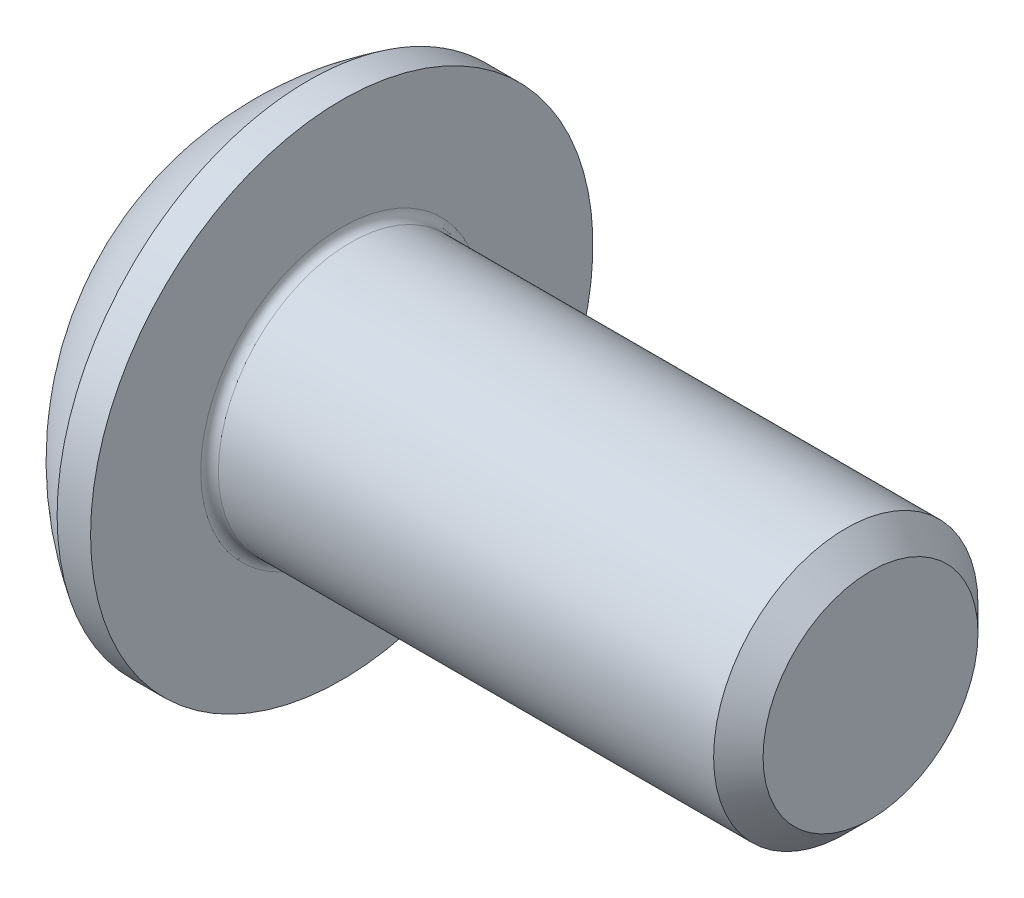
ISO-10303-21;
HEADER;
FILE_DESCRIPTION(('STEP AP214'),'2;1');
FILE_NAME('part.step','',(''),(''),'','','');
FILE_SCHEMA(('AUTOMOTIVE_DESIGN { 1 0 10303 214 1 1 1 1 }'));
ENDSEC;
DATA;
#1=APPLICATION_CONTEXT('core data for automotive mechanical design processes');
#2=APPLICATION_PROTOCOL_DEFINITION('international standard','automotive_design',2000,#1);
#3=PRODUCT_CONTEXT('',#1,'mechanical');
#4=PRODUCT('Part','Part','',(#3));
#5=PRODUCT_RELATED_PRODUCT_CATEGORY('part','',(#4));
#6=PRODUCT_DEFINITION_FORMATION('','',#4);
#7=PRODUCT_DEFINITION_CONTEXT('part definition',#1,'design');
#8=PRODUCT_DEFINITION('design','',#6,#7);
#9=PRODUCT_DEFINITION_SHAPE('','',#8);
#10=(LENGTH_UNIT() NAMED_UNIT(*) SI_UNIT(.MILLI.,.METRE.));
#11=(NAMED_UNIT(*) PLANE_ANGLE_UNIT() SI_UNIT($,.RADIAN.));
#12=(NAMED_UNIT(*) SI_UNIT($,.STERADIAN.) SOLID_ANGLE_UNIT());
#13=UNCERTAINTY_MEASURE_WITH_UNIT(LENGTH_MEASURE(1.E-05),#10,'distance_accuracy_value','');
#14=(GEOMETRIC_REPRESENTATION_CONTEXT(3) GLOBAL_UNCERTAINTY_ASSIGNED_CONTEXT((#13)) GLOBAL_UNIT_ASSIGNED_CONTEXT((#10,
#11,#12)) REPRESENTATION_CONTEXT('',''));
#15=CARTESIAN_POINT('',(0.,0.,0.));
#16=DIRECTION('',(0.,0.,1.));
#17=DIRECTION('',(1.,0.,0.));
#18=AXIS2_PLACEMENT_3D('',#15,#16,#17);
#19=CARTESIAN_POINT('',(1.04000000000026,0.,0.));
#20=DIRECTION('',(-1.,0.,0.));
#21=DIRECTION('',(0.,0.,1.));
#22=AXIS2_PLACEMENT_3D('',#19,#20,#21);
#23=CONICAL_SURFACE('',#22,0.99999999999989,1.04719755119658);
#24=CARTESIAN_POINT('',(1.61735026918985,0.,3.33066907387547E-13));
#25=VERTEX_POINT('',#24);
#26=VERTEX_LOOP('',#25);
#27=FACE_BOUND('',#26,.T.);
#28=CARTESIAN_POINT('',(1.04000000000013,0.,0.));
#29=DIRECTION('',(-1.,0.,0.));
#30=DIRECTION('',(0.,0.,1.));
#31=AXIS2_PLACEMENT_3D('',#28,#29,#30);
#32=CIRCLE('',#31,1.00000000000011);
#33=CARTESIAN_POINT('',(1.04000000000003,-0.866025403784488,0.500000000000025));
#34=VERTEX_POINT('',#33);
#35=CARTESIAN_POINT('',(1.04000000000004,0.,0.999999999999916));
#36=VERTEX_POINT('',#35);
#37=EDGE_CURVE('E97',#34,#36,#32,.T.);
#38=ORIENTED_EDGE('',*,*,#37,.T.);
#39=CARTESIAN_POINT('',(1.04000000000013,0.,0.));
#40=DIRECTION('',(-1.,0.,0.));
#41=DIRECTION('',(0.,0.,1.));
#42=AXIS2_PLACEMENT_3D('',#39,#40,#41);
#43=CIRCLE('',#42,1.00000000000011);
#44=CARTESIAN_POINT('',(1.04000000000003,0.86602540378449,0.500000000000026));
#45=VERTEX_POINT('',#44);
#46=EDGE_CURVE('E158',#36,#45,#43,.T.);
#47=ORIENTED_EDGE('',*,*,#46,.T.);
#48=CARTESIAN_POINT('',(1.04000000000013,0.,0.));
#49=DIRECTION('',(-1.,0.,0.));
#50=DIRECTION('',(0.,0.,1.));
#51=AXIS2_PLACEMENT_3D('',#48,#49,#50);
#52=CIRCLE('',#51,1.00000000000011);
#53=CARTESIAN_POINT('',(1.04000000000003,0.866025403784487,-0.500000000000028));
#54=VERTEX_POINT('',#53);
#55=EDGE_CURVE('E355',#45,#54,#52,.T.);
#56=ORIENTED_EDGE('',*,*,#55,.T.);
#57=CARTESIAN_POINT('',(1.04000000000013,0.,0.));
#58=DIRECTION('',(-1.,0.,0.));
#59=DIRECTION('',(0.,0.,1.));
#60=AXIS2_PLACEMENT_3D('',#57,#58,#59);
#61=CIRCLE('',#60,1.00000000000011);
#62=CARTESIAN_POINT('',(1.04000000000004,0.,-0.999999999999917));
#63=VERTEX_POINT('',#62);
#64=EDGE_CURVE('E356',#54,#63,#61,.T.);
#65=ORIENTED_EDGE('',*,*,#64,.T.);
#66=CARTESIAN_POINT('',(1.04000000000013,0.,0.));
#67=DIRECTION('',(-1.,0.,0.));
#68=DIRECTION('',(0.,0.,1.));
#69=AXIS2_PLACEMENT_3D('',#66,#67,#68);
#70=CIRCLE('',#69,1.00000000000011);
#71=CARTESIAN_POINT('',(1.04000000000003,-0.866025403784487,-0.500000000000025));
#72=VERTEX_POINT('',#71);
#73=EDGE_CURVE('E100',#63,#72,#70,.T.);
#74=ORIENTED_EDGE('',*,*,#73,.T.);
#75=CARTESIAN_POINT('',(1.04000000000013,0.,0.));
#76=DIRECTION('',(-1.,0.,0.));
#77=DIRECTION('',(0.,0.,1.));
#78=AXIS2_PLACEMENT_3D('',#75,#76,#77);
#79=CIRCLE('',#78,1.00000000000011);
#80=EDGE_CURVE('E95',#72,#34,#79,.T.);
#81=ORIENTED_EDGE('',*,*,#80,.T.);
#82=EDGE_LOOP('',(#38,#47,#56,#65,#74,#81));
#83=FACE_BOUND('',#82,.T.);
#84=ADVANCED_FACE('F16',(#27,#83),#23,.F.);
#85=CARTESIAN_POINT('',(1.03999999999993,-1.73205080756888,-1.));
#86=DIRECTION('',(1.,0.,0.));
#87=DIRECTION('',(0.,0.,-1.));
#88=AXIS2_PLACEMENT_3D('',#85,#86,#87);
#89=PLANE('',#88);
#90=DIRECTION('',(0.,0.499999999999999,0.866025403784439));
#91=VECTOR('',#90,1.);
#92=CARTESIAN_POINT('',(1.03999999999993,-1.15470053837925,0.));
#93=LINE('',#92,#91);
#94=CARTESIAN_POINT('',(1.03999999999993,-0.577350269189625,0.999999999999999));
#95=VERTEX_POINT('',#94);
#96=EDGE_CURVE('E109',#95,#34,#93,.F.);
#97=ORIENTED_EDGE('',*,*,#96,.F.);
#98=DIRECTION('',(0.,1.,0.));
#99=VECTOR('',#98,1.);
#100=CARTESIAN_POINT('',(1.03999999999993,-0.577350269189623,0.999999999999997));
#101=LINE('',#100,#99);
#102=EDGE_CURVE('E111',#36,#95,#101,.F.);
#103=ORIENTED_EDGE('',*,*,#102,.F.);
#104=ORIENTED_EDGE('',*,*,#37,.F.);
#105=EDGE_LOOP('',(#97,#103,#104));
#106=FACE_BOUND('',#105,.T.);
#107=ADVANCED_FACE('F107',(#106),#89,.F.);
#108=CARTESIAN_POINT('',(1.03999999999993,-1.73205080756888,-1.));
#109=DIRECTION('',(1.,0.,0.));
#110=DIRECTION('',(0.,0.,-1.));
#111=AXIS2_PLACEMENT_3D('',#108,#109,#110);
#112=PLANE('',#111);
#113=DIRECTION('',(0.,-0.499999999999997,0.86602540378444));
#114=VECTOR('',#113,1.);
#115=CARTESIAN_POINT('',(1.03999999999993,-0.577350269189623,-1.));
#116=LINE('',#115,#114);
#117=CARTESIAN_POINT('',(1.03999999999993,-1.15470053837925,0.));
#118=VERTEX_POINT('',#117);
#119=EDGE_CURVE('E118',#118,#72,#116,.F.);
#120=ORIENTED_EDGE('',*,*,#119,.F.);
#121=DIRECTION('',(0.,0.499999999999999,0.866025403784439));
#122=VECTOR('',#121,1.);
#123=CARTESIAN_POINT('',(1.03999999999993,-1.15470053837925,0.));
#124=LINE('',#123,#122);
#125=EDGE_CURVE('E115',#34,#118,#124,.F.);
#126=ORIENTED_EDGE('',*,*,#125,.F.);
#127=ORIENTED_EDGE('',*,*,#80,.F.);
#128=EDGE_LOOP('',(#120,#126,#127));
#129=FACE_BOUND('',#128,.T.);
#130=ADVANCED_FACE('F116',(#129),#112,.F.);
#131=CARTESIAN_POINT('',(1.03999999999993,-1.73205080756888,-1.));
#132=DIRECTION('',(1.,0.,0.));
#133=DIRECTION('',(0.,0.,-1.));
#134=AXIS2_PLACEMENT_3D('',#131,#132,#133);
#135=PLANE('',#134);
#136=DIRECTION('',(0.,-1.,0.));
#137=VECTOR('',#136,1.);
#138=CARTESIAN_POINT('',(1.03999999999993,0.57735026918963,-1.));
#139=LINE('',#138,#137);
#140=CARTESIAN_POINT('',(1.03999999999993,-0.577350269189623,-1.));
#141=VERTEX_POINT('',#140);
#142=EDGE_CURVE('E324',#141,#63,#139,.F.);
#143=ORIENTED_EDGE('',*,*,#142,.F.);
#144=DIRECTION('',(0.,-0.499999999999997,0.86602540378444));
#145=VECTOR('',#144,1.);
#146=CARTESIAN_POINT('',(1.03999999999993,-0.577350269189623,-1.));
#147=LINE('',#146,#145);
#148=EDGE_CURVE('E336',#72,#141,#147,.F.);
#149=ORIENTED_EDGE('',*,*,#148,.F.);
#150=ORIENTED_EDGE('',*,*,#73,.F.);
#151=EDGE_LOOP('',(#143,#149,#150));
#152=FACE_BOUND('',#151,.T.);
#153=ADVANCED_FACE('F202',(#152),#135,.F.);
#154=CARTESIAN_POINT('',(1.03999999999993,-1.73205080756888,-1.));
#155=DIRECTION('',(1.,0.,0.));
#156=DIRECTION('',(0.,0.,-1.));
#157=AXIS2_PLACEMENT_3D('',#154,#155,#156);
#158=PLANE('',#157);
#159=DIRECTION('',(0.,-0.499999999999998,-0.86602540378444));
#160=VECTOR('',#159,1.);
#161=CARTESIAN_POINT('',(1.03999999999993,1.15470053837925,0.));
#162=LINE('',#161,#160);
#163=CARTESIAN_POINT('',(1.03999999999993,0.577350269189627,-1.));
#164=VERTEX_POINT('',#163);
#165=EDGE_CURVE('E309',#164,#54,#162,.F.);
#166=ORIENTED_EDGE('',*,*,#165,.F.);
#167=DIRECTION('',(0.,-1.,0.));
#168=VECTOR('',#167,1.);
#169=CARTESIAN_POINT('',(1.03999999999993,0.57735026918963,-1.));
#170=LINE('',#169,#168);
#171=EDGE_CURVE('E321',#63,#164,#170,.F.);
#172=ORIENTED_EDGE('',*,*,#171,.F.);
#173=ORIENTED_EDGE('',*,*,#64,.F.);
#174=EDGE_LOOP('',(#166,#172,#173));
#175=FACE_BOUND('',#174,.T.);
#176=ADVANCED_FACE('F198',(#175),#158,.F.);
#177=CARTESIAN_POINT('',(1.03999999999993,-1.73205080756888,-1.));
#178=DIRECTION('',(1.,0.,0.));
#179=DIRECTION('',(0.,0.,-1.));
#180=AXIS2_PLACEMENT_3D('',#177,#178,#179);
#181=PLANE('',#180);
#182=DIRECTION('',(0.,0.499999999999998,-0.86602540378444));
#183=VECTOR('',#182,1.);
#184=CARTESIAN_POINT('',(1.03999999999993,0.57735026918963,1.));
#185=LINE('',#184,#183);
#186=CARTESIAN_POINT('',(1.03999999999993,1.15470053837925,0.));
#187=VERTEX_POINT('',#186);
#188=EDGE_CURVE('E287',#187,#45,#185,.F.);
#189=ORIENTED_EDGE('',*,*,#188,.F.);
#190=DIRECTION('',(0.,-0.499999999999998,-0.86602540378444));
#191=VECTOR('',#190,1.);
#192=CARTESIAN_POINT('',(1.03999999999993,1.15470053837925,0.));
#193=LINE('',#192,#191);
#194=EDGE_CURVE('E306',#54,#187,#193,.F.);
#195=ORIENTED_EDGE('',*,*,#194,.F.);
#196=ORIENTED_EDGE('',*,*,#55,.F.);
#197=EDGE_LOOP('',(#189,#195,#196));
#198=FACE_BOUND('',#197,.T.);
#199=ADVANCED_FACE('F194',(#198),#181,.F.);
#200=CARTESIAN_POINT('',(1.03999999999993,-1.73205080756888,-1.));
#201=DIRECTION('',(1.,0.,0.));
#202=DIRECTION('',(0.,0.,-1.));
#203=AXIS2_PLACEMENT_3D('',#200,#201,#202);
#204=PLANE('',#203);
#205=DIRECTION('',(0.,1.,0.));
#206=VECTOR('',#205,1.);
#207=CARTESIAN_POINT('',(1.03999999999993,-0.577350269189623,0.999999999999997));
#208=LINE('',#207,#206);
#209=CARTESIAN_POINT('',(1.03999999999993,0.57735026918963,1.));
#210=VERTEX_POINT('',#209);
#211=EDGE_CURVE('E127',#210,#36,#208,.F.);
#212=ORIENTED_EDGE('',*,*,#211,.F.);
#213=DIRECTION('',(0.,0.499999999999998,-0.86602540378444));
#214=VECTOR('',#213,1.);
#215=CARTESIAN_POINT('',(1.03999999999993,0.57735026918963,1.));
#216=LINE('',#215,#214);
#217=EDGE_CURVE('E290',#45,#210,#216,.F.);
#218=ORIENTED_EDGE('',*,*,#217,.F.);
#219=ORIENTED_EDGE('',*,*,#46,.F.);
#220=EDGE_LOOP('',(#212,#218,#219));
#221=FACE_BOUND('',#220,.T.);
#222=ADVANCED_FACE('F190',(#221),#204,.F.);
#223=CARTESIAN_POINT('',(1.03999999999993,-0.577350269189623,0.999999999999997));
#224=DIRECTION('',(0.,0.,-1.));
#225=DIRECTION('',(0.,1.,0.));
#226=AXIS2_PLACEMENT_3D('',#223,#224,#225);
#227=PLANE('',#226);
#228=DIRECTION('',(0.,1.,0.));
#229=VECTOR('',#228,1.);
#230=CARTESIAN_POINT('',(0.,0.,1.));
#231=LINE('',#230,#229);
#232=CARTESIAN_POINT('',(0.,0.57735026918963,1.));
#233=VERTEX_POINT('',#232);
#234=CARTESIAN_POINT('',(0.,-0.577350269189623,0.999999999999999));
#235=VERTEX_POINT('',#234);
#236=EDGE_CURVE('E283',#233,#235,#231,.F.);
#237=ORIENTED_EDGE('',*,*,#236,.F.);
#238=DIRECTION('',(1.,0.,0.));
#239=VECTOR('',#238,1.);
#240=CARTESIAN_POINT('',(1.03999999999993,0.57735026918963,1.));
#241=LINE('',#240,#239);
#242=EDGE_CURVE('E296',#210,#233,#241,.F.);
#243=ORIENTED_EDGE('',*,*,#242,.F.);
#244=ORIENTED_EDGE('',*,*,#211,.T.);
#245=ORIENTED_EDGE('',*,*,#102,.T.);
#246=DIRECTION('',(1.,0.,0.));
#247=VECTOR('',#246,1.);
#248=CARTESIAN_POINT('',(1.03999999999993,-0.577350269189625,0.999999999999999));
#249=LINE('',#248,#247);
#250=EDGE_CURVE('E121',#235,#95,#249,.T.);
#251=ORIENTED_EDGE('',*,*,#250,.F.);
#252=EDGE_LOOP('',(#237,#243,#244,#245,#251));
#253=FACE_BOUND('',#252,.T.);
#254=ADVANCED_FACE('F187',(#253),#227,.T.);
#255=CARTESIAN_POINT('',(1.03999999999993,-1.15470053837925,0.));
#256=DIRECTION('',(0.,0.866025403784439,-0.499999999999999));
#257=DIRECTION('',(0.,0.499999999999999,0.866025403784439));
#258=AXIS2_PLACEMENT_3D('',#255,#256,#257);
#259=PLANE('',#258);
#260=DIRECTION('',(0.,-0.500000000000001,-0.866025403784438));
#261=VECTOR('',#260,1.);
#262=CARTESIAN_POINT('',(0.,-0.577350269189623,0.999999999999997));
#263=LINE('',#262,#261);
#264=CARTESIAN_POINT('',(0.,-1.15470053837925,0.));
#265=VERTEX_POINT('',#264);
#266=EDGE_CURVE('E280',#235,#265,#263,.T.);
#267=ORIENTED_EDGE('',*,*,#266,.F.);
#268=ORIENTED_EDGE('',*,*,#250,.T.);
#269=ORIENTED_EDGE('',*,*,#96,.T.);
#270=ORIENTED_EDGE('',*,*,#125,.T.);
#271=DIRECTION('',(1.,0.,0.));
#272=VECTOR('',#271,1.);
#273=CARTESIAN_POINT('',(1.03999999999993,-1.15470053837925,0.));
#274=LINE('',#273,#272);
#275=EDGE_CURVE('E333',#265,#118,#274,.T.);
#276=ORIENTED_EDGE('',*,*,#275,.F.);
#277=EDGE_LOOP('',(#267,#268,#269,#270,#276));
#278=FACE_BOUND('',#277,.T.);
#279=ADVANCED_FACE('F125',(#278),#259,.T.);
#280=CARTESIAN_POINT('',(1.03999999999993,-0.577350269189623,-1.));
#281=DIRECTION('',(0.,0.86602540378444,0.499999999999997));
#282=DIRECTION('',(0.,-0.499999999999997,0.86602540378444));
#283=AXIS2_PLACEMENT_3D('',#280,#281,#282);
#284=PLANE('',#283);
#285=DIRECTION('',(0.,0.5,-0.866025403784439));
#286=VECTOR('',#285,1.);
#287=CARTESIAN_POINT('',(0.,-1.15470053837925,0.));
#288=LINE('',#287,#286);
#289=CARTESIAN_POINT('',(0.,-0.577350269189623,-1.));
#290=VERTEX_POINT('',#289);
#291=EDGE_CURVE('E277',#265,#290,#288,.T.);
#292=ORIENTED_EDGE('',*,*,#291,.F.);
#293=ORIENTED_EDGE('',*,*,#275,.T.);
#294=ORIENTED_EDGE('',*,*,#119,.T.);
#295=ORIENTED_EDGE('',*,*,#148,.T.);
#296=DIRECTION('',(1.,0.,0.));
#297=VECTOR('',#296,1.);
#298=CARTESIAN_POINT('',(1.03999999999993,-0.577350269189623,-1.));
#299=LINE('',#298,#297);
#300=EDGE_CURVE('E318',#290,#141,#299,.T.);
#301=ORIENTED_EDGE('',*,*,#300,.F.);
#302=EDGE_LOOP('',(#292,#293,#294,#295,#301));
#303=FACE_BOUND('',#302,.T.);
#304=ADVANCED_FACE('F180',(#303),#284,.T.);
#305=CARTESIAN_POINT('',(1.03999999999993,0.57735026918963,-1.));
#306=DIRECTION('',(0.,0.,1.));
#307=DIRECTION('',(0.,-1.,0.));
#308=AXIS2_PLACEMENT_3D('',#305,#306,#307);
#309=PLANE('',#308);
#310=DIRECTION('',(0.,1.,0.));
#311=VECTOR('',#310,1.);
#312=CARTESIAN_POINT('',(0.,0.,-1.));
#313=LINE('',#312,#311);
#314=CARTESIAN_POINT('',(0.,0.577350269189629,-1.));
#315=VERTEX_POINT('',#314);
#316=EDGE_CURVE('E274',#290,#315,#313,.T.);
#317=ORIENTED_EDGE('',*,*,#316,.F.);
#318=ORIENTED_EDGE('',*,*,#300,.T.);
#319=ORIENTED_EDGE('',*,*,#142,.T.);
#320=ORIENTED_EDGE('',*,*,#171,.T.);
#321=DIRECTION('',(1.,0.,0.));
#322=VECTOR('',#321,1.);
#323=CARTESIAN_POINT('',(1.03999999999993,0.577350269189626,-0.999999999999999));
#324=LINE('',#323,#322);
#325=EDGE_CURVE('E291',#315,#164,#324,.T.);
#326=ORIENTED_EDGE('',*,*,#325,.F.);
#327=EDGE_LOOP('',(#317,#318,#319,#320,#326));
#328=FACE_BOUND('',#327,.T.);
#329=ADVANCED_FACE('F176',(#328),#309,.T.);
#330=CARTESIAN_POINT('',(1.03999999999993,1.15470053837925,0.));
#331=DIRECTION('',(0.,-0.86602540378444,0.499999999999998));
#332=DIRECTION('',(0.,-0.499999999999998,-0.86602540378444));
#333=AXIS2_PLACEMENT_3D('',#330,#331,#332);
#334=PLANE('',#333);
#335=DIRECTION('',(0.,0.499999999999996,0.866025403784441));
#336=VECTOR('',#335,1.);
#337=CARTESIAN_POINT('',(0.,0.57735026918963,-1.));
#338=LINE('',#337,#336);
#339=CARTESIAN_POINT('',(0.,1.15470053837925,0.));
#340=VERTEX_POINT('',#339);
#341=EDGE_CURVE('E271',#315,#340,#338,.T.);
#342=ORIENTED_EDGE('',*,*,#341,.F.);
#343=ORIENTED_EDGE('',*,*,#325,.T.);
#344=ORIENTED_EDGE('',*,*,#165,.T.);
#345=ORIENTED_EDGE('',*,*,#194,.T.);
#346=DIRECTION('',(1.,0.,0.));
#347=VECTOR('',#346,1.);
#348=CARTESIAN_POINT('',(1.03999999999993,1.15470053837925,0.));
#349=LINE('',#348,#347);
#350=EDGE_CURVE('E286',#340,#187,#349,.T.);
#351=ORIENTED_EDGE('',*,*,#350,.F.);
#352=EDGE_LOOP('',(#342,#343,#344,#345,#351));
#353=FACE_BOUND('',#352,.T.);
#354=ADVANCED_FACE('F172',(#353),#334,.T.);
#355=CARTESIAN_POINT('',(1.03999999999993,0.57735026918963,1.));
#356=DIRECTION('',(0.,-0.86602540378444,-0.499999999999998));
#357=DIRECTION('',(0.,0.499999999999998,-0.86602540378444));
#358=AXIS2_PLACEMENT_3D('',#355,#356,#357);
#359=PLANE('',#358);
#360=DIRECTION('',(0.,-0.499999999999996,0.866025403784441));
#361=VECTOR('',#360,1.);
#362=CARTESIAN_POINT('',(0.,1.15470053837925,0.));
#363=LINE('',#362,#361);
#364=EDGE_CURVE('E157',#340,#233,#363,.T.);
#365=ORIENTED_EDGE('',*,*,#364,.F.);
#366=ORIENTED_EDGE('',*,*,#350,.T.);
#367=ORIENTED_EDGE('',*,*,#188,.T.);
#368=ORIENTED_EDGE('',*,*,#217,.T.);
#369=ORIENTED_EDGE('',*,*,#242,.T.);
#370=EDGE_LOOP('',(#365,#366,#367,#368,#369));
#371=FACE_BOUND('',#370,.T.);
#372=ADVANCED_FACE('F168',(#371),#359,.T.);
#373=CARTESIAN_POINT('',(0.,0.,0.));
#374=DIRECTION('',(-1.,0.,0.));
#375=DIRECTION('',(0.,0.,1.));
#376=AXIS2_PLACEMENT_3D('',#373,#374,#375);
#377=PLANE('',#376);
#378=ORIENTED_EDGE('',*,*,#341,.T.);
#379=ORIENTED_EDGE('',*,*,#364,.T.);
#380=ORIENTED_EDGE('',*,*,#236,.T.);
#381=ORIENTED_EDGE('',*,*,#266,.T.);
#382=ORIENTED_EDGE('',*,*,#291,.T.);
#383=ORIENTED_EDGE('',*,*,#316,.T.);
#384=EDGE_LOOP('',(#378,#379,#380,#381,#382,#383));
#385=FACE_BOUND('',#384,.T.);
#386=CARTESIAN_POINT('',(0.,1.42499999999991,0.));
#387=CARTESIAN_POINT('',(1.41401909941221E-13,1.42499547133831,0.0799833360146241));
#388=CARTESIAN_POINT('',(1.14531875076236E-13,1.41822890220758,0.160109019716947));
#389=CARTESIAN_POINT('',(0.,1.39809415024747,0.278523524351196));
#390=CARTESIAN_POINT('',(-1.36863752895278E-13,1.38970085869293,0.317749539599044));
#391=CARTESIAN_POINT('',(1.36975050238227E-13,1.36963357855856,0.395393827236229));
#392=CARTESIAN_POINT('',(4.90613092188047E-13,1.35795692767256,0.433811416830798));
#393=CARTESIAN_POINT('',(8.08502525158743E-13,1.31816256652485,0.547245538496193));
#394=CARTESIAN_POINT('',(0.,1.28524776326101,0.62063435186627));
#395=CARTESIAN_POINT('',(0.,1.2075483656717,0.760838579302516));
#396=CARTESIAN_POINT('',(6.68760632896524E-13,1.16276332012511,0.827653743353454));
#397=CARTESIAN_POINT('',(4.22719058943647E-13,1.08769646787847,0.921494986115497));
#398=CARTESIAN_POINT('',(1.23148001965927E-13,1.0613394821269,0.951729494931846));
#399=CARTESIAN_POINT('',(-1.23029268744087E-13,1.00620185445041,1.00984457256197));
#400=CARTESIAN_POINT('',(0.,0.977423573796169,1.03772738282286));
#401=CARTESIAN_POINT('',(1.39906133813925E-13,0.887686851976157,1.11760418663794));
#402=CARTESIAN_POINT('',(3.47455893346232E-13,0.823310261143306,1.1658468514302));
#403=CARTESIAN_POINT('',(3.20413154846107E-13,0.687406523978961,1.25081092212933));
#404=CARTESIAN_POINT('',(0.,0.615879647408062,1.28753276246904));
#405=CARTESIAN_POINT('',(0.,0.467668101636246,1.34845363271997));
#406=CARTESIAN_POINT('',(0.,0.390983487532258,1.37265279637922));
#407=CARTESIAN_POINT('',(0.,0.234641768263888,1.40783152102352));
#408=CARTESIAN_POINT('',(0.,0.154984647227404,1.41881101140992));
#409=CARTESIAN_POINT('',(0.,-0.00504231192438026,1.42724192135203));
#410=CARTESIAN_POINT('',(0.,-0.0854121500396795,1.42469334090774));
#411=CARTESIAN_POINT('',(0.,-0.244584849637582,1.40613727575172));
#412=CARTESIAN_POINT('',(0.,-0.323387719486132,1.39012986291562));
#413=CARTESIAN_POINT('',(0.,-0.477180160001665,1.34511986433288));
#414=CARTESIAN_POINT('',(0.,-0.552169689930566,1.31611713978921));
#415=CARTESIAN_POINT('',(0.,-0.696248843253798,1.24590377451843));
#416=CARTESIAN_POINT('',(0.,-0.765338244029784,1.20469267341783));
#417=CARTESIAN_POINT('',(0.,-0.8629714037676,1.13468732254868));
#418=CARTESIAN_POINT('',(0.,-0.894520211596362,1.10998280332566));
#419=CARTESIAN_POINT('',(0.,-0.955459158435755,1.05798313994372));
#420=CARTESIAN_POINT('',(0.,-0.984847184771934,1.03068551863096));
#421=CARTESIAN_POINT('',(0.,-1.06935902683452,0.945251569286646));
#422=CARTESIAN_POINT('',(0.,-1.12091688115591,0.883512164450193));
#423=CARTESIAN_POINT('',(0.,-1.2129183767408,0.752248511496138));
#424=CARTESIAN_POINT('',(0.,-1.2533624404567,0.682724559422658));
#425=CARTESIAN_POINT('',(0.,-1.30485581691183,0.574099869234571));
#426=CARTESIAN_POINT('',(0.,-1.32050463064858,0.537121902892333));
#427=CARTESIAN_POINT('',(0.,-1.34861944625482,0.462016055728994));
#428=CARTESIAN_POINT('',(0.,-1.36108802394618,0.423889133669822));
#429=CARTESIAN_POINT('',(1.81511978732957E-13,-1.39355394851479,0.308245859389784));
#430=CARTESIAN_POINT('',(9.8800978305374E-13,-1.40870242218982,0.229274754599015));
#431=CARTESIAN_POINT('',(3.75337112713248E-13,-1.41974083887083,0.124862105658288));
#432=CARTESIAN_POINT('',(1.04888549676474E-13,-1.4217113220651,0.0999338996932106));
#433=CARTESIAN_POINT('',(-1.04888549676541E-13,-1.42434161069689,0.0500084356096711));
#434=CARTESIAN_POINT('',(0.,-1.4250014161344,0.0250111774912094));
#435=CARTESIAN_POINT('',(1.41401981085223E-13,-1.42499547133833,-0.0799833360146248));
#436=CARTESIAN_POINT('',(1.14531823815202E-13,-1.4182289022076,-0.160109019716947));
#437=CARTESIAN_POINT('',(0.,-1.39809415024749,-0.278523524351197));
#438=CARTESIAN_POINT('',(-1.36863657854438E-13,-1.38970085869296,-0.317749539599045));
#439=CARTESIAN_POINT('',(1.369749551201E-13,-1.36963357855858,-0.39539382723623));
#440=CARTESIAN_POINT('',(4.90612737300539E-13,-1.35795692767258,-0.433811416830799));
#441=CARTESIAN_POINT('',(8.08503233242052E-13,-1.31816256652487,-0.547245538496193));
#442=CARTESIAN_POINT('',(0.,-1.28524776326103,-0.62063435186627));
#443=CARTESIAN_POINT('',(0.,-1.20754836567172,-0.760838579302516));
#444=CARTESIAN_POINT('',(6.6874588779984E-13,-1.16276332012513,-0.827653743353455));
#445=CARTESIAN_POINT('',(4.22726441152782E-13,-1.08769646787849,-0.921494986115498));
#446=CARTESIAN_POINT('',(1.23169189925226E-13,-1.06133948212692,-0.951729494931847));
#447=CARTESIAN_POINT('',(-1.23050436275001E-13,-1.00620185445043,-1.00984457256197));
#448=CARTESIAN_POINT('',(0.,-0.977423573796189,-1.03772738282286));
#449=CARTESIAN_POINT('',(1.40060606893405E-13,-0.887686851976178,-1.11760418663794));
#450=CARTESIAN_POINT('',(3.48297917793837E-13,-0.823310261143327,-1.1658468514302));
#451=CARTESIAN_POINT('',(3.21305852918933E-13,-0.687406523978982,-1.25081092212933));
#452=CARTESIAN_POINT('',(0.,-0.615879647408082,-1.28753276246904));
#453=CARTESIAN_POINT('',(0.,-0.467668101636265,-1.34845363271997));
#454=CARTESIAN_POINT('',(0.,-0.390983487532277,-1.37265279637922));
#455=CARTESIAN_POINT('',(0.,-0.234641768263907,-1.40783152102352));
#456=CARTESIAN_POINT('',(0.,-0.154984647227423,-1.41881101140992));
#457=CARTESIAN_POINT('',(0.,0.00504231192436084,-1.42724192135203));
#458=CARTESIAN_POINT('',(0.,0.0854121500396599,-1.42469334090774));
#459=CARTESIAN_POINT('',(0.,0.244584849637563,-1.40613727575172));
#460=CARTESIAN_POINT('',(0.,0.323387719486113,-1.39012986291562));
#461=CARTESIAN_POINT('',(0.,0.477180160001645,-1.34511986433288));
#462=CARTESIAN_POINT('',(0.,0.552169689930545,-1.31611713978921));
#463=CARTESIAN_POINT('',(0.,0.696248843253777,-1.24590377451842));
#464=CARTESIAN_POINT('',(0.,0.765338244029764,-1.20469267341783));
#465=CARTESIAN_POINT('',(0.,0.862971403767579,-1.13468732254867));
#466=CARTESIAN_POINT('',(0.,0.89452021159634,-1.10998280332566));
#467=CARTESIAN_POINT('',(0.,0.955459158435734,-1.05798313994372));
#468=CARTESIAN_POINT('',(0.,0.984847184771914,-1.03068551863097));
#469=CARTESIAN_POINT('',(0.,1.06935902683451,-0.945251569286649));
#470=CARTESIAN_POINT('',(0.,1.12091688115589,-0.883512164450194));
#471=CARTESIAN_POINT('',(0.,1.21291837674078,-0.752248511496137));
#472=CARTESIAN_POINT('',(0.,1.25336244045668,-0.682724559422657));
#473=CARTESIAN_POINT('',(0.,1.30485581691181,-0.574099869234571));
#474=CARTESIAN_POINT('',(0.,1.32050463064856,-0.537121902892333));
#475=CARTESIAN_POINT('',(0.,1.3486194462548,-0.462016055728993));
#476=CARTESIAN_POINT('',(0.,1.36108802394616,-0.423889133669821));
#477=CARTESIAN_POINT('',(1.81517543922135E-13,1.39355394851477,-0.308245859389783));
#478=CARTESIAN_POINT('',(9.8801052315667E-13,1.4087024221898,-0.229274754599014));
#479=CARTESIAN_POINT('',(3.7533688127947E-13,1.41974083887081,-0.124862105658288));
#480=CARTESIAN_POINT('',(1.0488848625626E-13,1.42171132206508,-0.0999338996932104));
#481=CARTESIAN_POINT('',(-1.04888486256328E-13,1.42434161069686,-0.0500084356096714));
#482=CARTESIAN_POINT('',(0.,1.42500141613438,-0.0250111774912099));
#483=CARTESIAN_POINT('',(0.,1.42499999999991,0.));
#484=B_SPLINE_CURVE_WITH_KNOTS('',3,(#386,#387,#388,#389,#390,#391,#392,#393,#394,#395,#396,
#397,#398,#399,#400,#401,#402,#403,#404,#405,#406,#407,#408,#409,#410,#411,#412,#413,#414,#415,
#416,#417,#418,#419,#420,#421,#422,#423,#424,#425,#426,#427,#428,#429,#430,#431,#432,#433,#434,
#435,#436,#437,#438,#439,#440,#441,#442,#443,#444,#445,#446,#447,#448,#449,#450,#451,#452,#453,
#454,#455,#456,#457,#458,#459,#460,#461,#462,#463,#464,#465,#466,#467,#468,#469,#470,#471,#472,
#473,#474,#475,#476,#477,#478,#479,#480,#481,#482,#483),.UNSPECIFIED.,.T.,.F.,(4,2,2,2,2,2,2,2,
2,2,2,2,2,2,2,2,2,2,2,2,2,2,2,2,2,2,2,2,2,2,2,2,2,2,2,2,2,2,2,2,2,2,2,2,2,2,2,2,4),(0.,
0.239833624278644,0.360065645132434,0.480395438436383,0.72048142713597,0.960576543485305,
1.08078140880884,1.20087037853754,1.44097126816492,1.68106310286293,1.92115237321524,
2.16124292574023,2.40133347826517,2.64142274861718,2.88151458331504,3.12161547294237,
3.24170444267091,3.36190930799436,3.60200442434396,3.84209041304366,3.96242020634782,
4.08265222720191,4.32248585148035,4.3974829901855,4.4724801288907,4.71231375316934,
4.83254577402313,4.95287556732708,5.19296155602667,5.433056672376,5.55326153769954,
5.67335050742823,5.91345139705561,6.15354323175363,6.39363250210594,6.63372305463093,
6.87381360715586,7.11390287750788,7.35399471220574,7.59409560183307,7.71418457156161,
7.83438943688506,8.07448455323465,8.31457054193436,8.43490033523852,8.5551323560926,
8.79496598037104,8.86996311907619,8.94496025778139),.UNSPECIFIED.);
#485=CARTESIAN_POINT('',(0.,1.42499999999991,0.));
#486=VERTEX_POINT('',#485);
#487=EDGE_CURVE('E150',#486,#486,#484,.T.);
#488=ORIENTED_EDGE('',*,*,#487,.F.);
#489=EDGE_LOOP('',(#488));
#490=FACE_BOUND('',#489,.T.);
#491=ADVANCED_FACE('F164',(#385,#490),#377,.T.);
#492=CARTESIAN_POINT('',(3.03337598425202,0.,0.));
#493=DIRECTION('',(0.,1.,0.));
#494=DIRECTION('',(1.,0.,0.));
#495=AXIS2_PLACEMENT_3D('',#492,#493,#494);
#496=SPHERICAL_SURFACE('',#495,3.35141684393879);
#497=CARTESIAN_POINT('',(1.2700000000001,0.,0.));
#498=DIRECTION('',(-1.,0.,0.));
#499=DIRECTION('',(0.,0.,1.));
#500=AXIS2_PLACEMENT_3D('',#497,#498,#499);
#501=CIRCLE('',#500,2.85);
#502=CARTESIAN_POINT('',(1.2700000000001,0.,2.85));
#503=VERTEX_POINT('',#502);
#504=EDGE_CURVE('E147',#503,#503,#501,.F.);
#505=ORIENTED_EDGE('',*,*,#504,.F.);
#506=EDGE_LOOP('',(#505));
#507=FACE_BOUND('',#506,.T.);
#508=ORIENTED_EDGE('',*,*,#487,.T.);
#509=EDGE_LOOP('',(#508));
#510=FACE_BOUND('',#509,.T.);
#511=ADVANCED_FACE('F160',(#507,#510),#496,.T.);
#512=CARTESIAN_POINT('',(0.,0.,0.));
#513=DIRECTION('',(-1.,0.,0.));
#514=DIRECTION('',(0.,0.,1.));
#515=AXIS2_PLACEMENT_3D('',#512,#513,#514);
#516=CYLINDRICAL_SURFACE('',#515,2.85);
#517=ORIENTED_EDGE('',*,*,#504,.T.);
#518=EDGE_LOOP('',(#517));
#519=FACE_BOUND('',#518,.T.);
#520=CARTESIAN_POINT('',(1.64999999999993,0.,0.));
#521=DIRECTION('',(-1.,0.,0.));
#522=DIRECTION('',(0.,0.,1.));
#523=AXIS2_PLACEMENT_3D('',#520,#521,#522);
#524=CIRCLE('',#523,2.85);
#525=CARTESIAN_POINT('',(1.64999999999993,0.,2.85));
#526=VERTEX_POINT('',#525);
#527=EDGE_CURVE('E144',#526,#526,#524,.T.);
#528=ORIENTED_EDGE('',*,*,#527,.T.);
#529=EDGE_LOOP('',(#528));
#530=FACE_BOUND('',#529,.T.);
#531=ADVANCED_FACE('F369',(#519,#530),#516,.T.);
#532=CARTESIAN_POINT('',(7.64999999999993,0.,0.));
#533=DIRECTION('',(-1.,0.,0.));
#534=DIRECTION('',(0.,0.,1.));
#535=AXIS2_PLACEMENT_3D('',#532,#533,#534);
#536=PLANE('',#535);
#537=CARTESIAN_POINT('',(7.65000000001237,0.,0.));
#538=DIRECTION('',(-1.,0.,0.));
#539=DIRECTION('',(0.,0.,1.));
#540=AXIS2_PLACEMENT_3D('',#537,#538,#539);
#541=CIRCLE('',#540,1.21949999993376);
#542=CARTESIAN_POINT('',(7.65000000001237,0.,1.21949999993376));
#543=VERTEX_POINT('',#542);
#544=EDGE_CURVE('E140',#543,#543,#541,.T.);
#545=ORIENTED_EDGE('',*,*,#544,.F.);
#546=EDGE_LOOP('',(#545));
#547=FACE_BOUND('',#546,.T.);
#548=ADVANCED_FACE('F247',(#547),#536,.F.);
#549=CARTESIAN_POINT('',(1.64999999999993,1.49999999999999,0.));
#550=DIRECTION('',(-1.,0.,0.));
#551=DIRECTION('',(0.,0.,1.));
#552=AXIS2_PLACEMENT_3D('',#549,#550,#551);
#553=PLANE('',#552);
#554=ORIENTED_EDGE('',*,*,#527,.F.);
#555=EDGE_LOOP('',(#554));
#556=FACE_BOUND('',#555,.T.);
#557=CARTESIAN_POINT('',(1.64999999999992,0.,0.));
#558=DIRECTION('',(1.,0.,0.));
#559=DIRECTION('',(0.,0.,1.));
#560=AXIS2_PLACEMENT_3D('',#557,#558,#559);
#561=CIRCLE('',#560,1.6);
#562=CARTESIAN_POINT('',(1.64999999999992,0.,-1.6));
#563=VERTEX_POINT('',#562);
#564=CARTESIAN_POINT('',(1.64999999999992,0.,1.6));
#565=VERTEX_POINT('',#564);
#566=EDGE_CURVE('E143',#563,#565,#561,.F.);
#567=ORIENTED_EDGE('',*,*,#566,.T.);
#568=CARTESIAN_POINT('',(1.64999999999992,0.,0.));
#569=DIRECTION('',(1.,0.,0.));
#570=DIRECTION('',(0.,0.,-1.));
#571=AXIS2_PLACEMENT_3D('',#568,#569,#570);
#572=CIRCLE('',#571,1.6);
#573=EDGE_CURVE('E35',#565,#563,#572,.F.);
#574=ORIENTED_EDGE('',*,*,#573,.T.);
#575=EDGE_LOOP('',(#567,#574));
#576=FACE_BOUND('',#575,.T.);
#577=ADVANCED_FACE('F238',(#556,#576),#553,.F.);
#578=CARTESIAN_POINT('',(7.3694999999816,0.,0.));
#579=DIRECTION('',(-1.,0.,0.));
#580=DIRECTION('',(0.,0.,1.));
#581=AXIS2_PLACEMENT_3D('',#578,#579,#580);
#582=CONICAL_SURFACE('',#581,1.49999999996453,0.785398163397448);
#583=CARTESIAN_POINT('',(7.36950000000003,0.,0.));
#584=DIRECTION('',(-1.,0.,0.));
#585=DIRECTION('',(0.,0.,1.));
#586=AXIS2_PLACEMENT_3D('',#583,#584,#585);
#587=CIRCLE('',#586,1.5);
#588=CARTESIAN_POINT('',(7.36950000000003,0.,1.5));
#589=VERTEX_POINT('',#588);
#590=EDGE_CURVE('E27',#589,#589,#587,.T.);
#591=ORIENTED_EDGE('',*,*,#590,.F.);
#592=EDGE_LOOP('',(#591));
#593=FACE_BOUND('',#592,.T.);
#594=ORIENTED_EDGE('',*,*,#544,.T.);
#595=EDGE_LOOP('',(#594));
#596=FACE_BOUND('',#595,.T.);
#597=ADVANCED_FACE('F222',(#593,#596),#582,.T.);
#598=CARTESIAN_POINT('',(1.74999999999992,0.,0.));
#599=DIRECTION('',(-1.,0.,0.));
#600=DIRECTION('',(0.,0.,1.));
#601=AXIS2_PLACEMENT_3D('',#598,#599,#600);
#602=TOROIDAL_SURFACE('',#601,1.6,0.1);
#603=ORIENTED_EDGE('',*,*,#573,.F.);
#604=ORIENTED_EDGE('',*,*,#566,.F.);
#605=EDGE_LOOP('',(#603,#604));
#606=FACE_BOUND('',#605,.T.);
#607=CARTESIAN_POINT('',(1.74999999999992,0.,0.));
#608=DIRECTION('',(-1.,0.,0.));
#609=DIRECTION('',(0.,0.,1.));
#610=AXIS2_PLACEMENT_3D('',#607,#608,#609);
#611=CIRCLE('',#610,1.5);
#612=CARTESIAN_POINT('',(1.74999999999992,0.,1.5));
#613=VERTEX_POINT('',#612);
#614=EDGE_CURVE('E11',#613,#613,#611,.F.);
#615=ORIENTED_EDGE('',*,*,#614,.F.);
#616=EDGE_LOOP('',(#615));
#617=FACE_BOUND('',#616,.T.);
#618=ADVANCED_FACE('F216',(#606,#617),#602,.F.);
#619=CARTESIAN_POINT('',(0.,0.,0.));
#620=DIRECTION('',(-1.,0.,0.));
#621=DIRECTION('',(0.,0.,1.));
#622=AXIS2_PLACEMENT_3D('',#619,#620,#621);
#623=CYLINDRICAL_SURFACE('',#622,1.5);
#624=ORIENTED_EDGE('',*,*,#614,.T.);
#625=EDGE_LOOP('',(#624));
#626=FACE_BOUND('',#625,.T.);
#627=ORIENTED_EDGE('',*,*,#590,.T.);
#628=EDGE_LOOP('',(#627));
#629=FACE_BOUND('',#628,.T.);
#630=ADVANCED_FACE('F214',(#626,#629),#623,.T.);
#631=CLOSED_SHELL('',(#84,#107,#130,#153,#176,#199,#222,#254,#279,#304,#329,#354,#372,#491,#511,
#531,#548,#577,#597,#618,#630));
#632=MANIFOLD_SOLID_BREP('B1',#631);
#633=ADVANCED_BREP_SHAPE_REPRESENTATION('',(#18,#632),#14);
#634=SHAPE_DEFINITION_REPRESENTATION(#9,#633);
ENDSEC;
END-ISO-10303-21;
